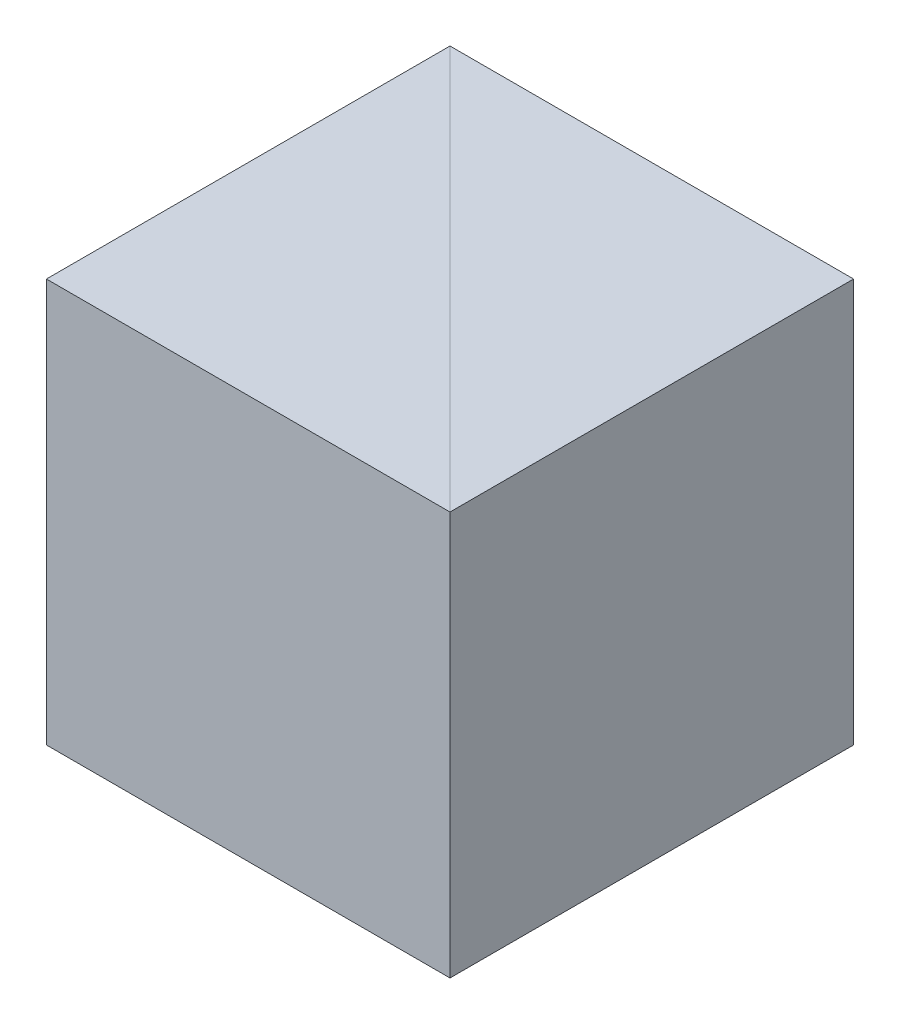
ISO-10303-21;
HEADER;
FILE_DESCRIPTION(('STEP AP214'),'2;1');
FILE_NAME('part.step','',(''),(''),'','','');
FILE_SCHEMA(('AUTOMOTIVE_DESIGN { 1 0 10303 214 1 1 1 1 }'));
ENDSEC;
DATA;
#1=APPLICATION_CONTEXT('core data for automotive mechanical design processes');
#2=APPLICATION_PROTOCOL_DEFINITION('international standard','automotive_design',2000,#1);
#3=PRODUCT_CONTEXT('',#1,'mechanical');
#4=PRODUCT('Part','Part','',(#3));
#5=PRODUCT_RELATED_PRODUCT_CATEGORY('part','',(#4));
#6=PRODUCT_DEFINITION_FORMATION('','',#4);
#7=PRODUCT_DEFINITION_CONTEXT('part definition',#1,'design');
#8=PRODUCT_DEFINITION('design','',#6,#7);
#9=PRODUCT_DEFINITION_SHAPE('','',#8);
#10=(LENGTH_UNIT() NAMED_UNIT(*) SI_UNIT(.MILLI.,.METRE.));
#11=(NAMED_UNIT(*) PLANE_ANGLE_UNIT() SI_UNIT($,.RADIAN.));
#12=(NAMED_UNIT(*) SI_UNIT($,.STERADIAN.) SOLID_ANGLE_UNIT());
#13=UNCERTAINTY_MEASURE_WITH_UNIT(LENGTH_MEASURE(1.E-05),#10,'distance_accuracy_value','');
#14=(GEOMETRIC_REPRESENTATION_CONTEXT(3) GLOBAL_UNCERTAINTY_ASSIGNED_CONTEXT((#13)) GLOBAL_UNIT_ASSIGNED_CONTEXT((#10,
#11,#12)) REPRESENTATION_CONTEXT('',''));
#15=CARTESIAN_POINT('',(0.,0.,0.));
#16=DIRECTION('',(0.,0.,1.));
#17=DIRECTION('',(1.,0.,0.));
#18=AXIS2_PLACEMENT_3D('',#15,#16,#17);
#19=CARTESIAN_POINT('',(25.4,25.4,0.));
#20=DIRECTION('',(-0.707106781186548,0.,0.707106781186548));
#21=DIRECTION('',(0.707106781186548,0.,0.707106781186548));
#22=AXIS2_PLACEMENT_3D('',#19,#20,#21);
#23=PLANE('',#22);
#24=DIRECTION('',(-0.707106781186547,0.,-0.707106781186547));
#25=VECTOR('',#24,1.);
#26=CARTESIAN_POINT('',(25.4,0.,0.));
#27=LINE('',#26,#25);
#28=CARTESIAN_POINT('',(25.4,0.,0.));
#29=VERTEX_POINT('',#28);
#30=CARTESIAN_POINT('',(0.,0.,-25.4));
#31=VERTEX_POINT('',#30);
#32=EDGE_CURVE('E97',#29,#31,#27,.T.);
#33=ORIENTED_EDGE('',*,*,#32,.F.);
#34=DIRECTION('',(0.,-1.,0.));
#35=VECTOR('',#34,1.);
#36=CARTESIAN_POINT('',(25.4,25.4,0.));
#37=LINE('',#36,#35);
#38=CARTESIAN_POINT('',(25.4,25.4,0.));
#39=VERTEX_POINT('',#38);
#40=EDGE_CURVE('E12',#39,#29,#37,.T.);
#41=ORIENTED_EDGE('',*,*,#40,.F.);
#42=DIRECTION('',(-0.707106781186547,0.,-0.707106781186547));
#43=VECTOR('',#42,1.);
#44=CARTESIAN_POINT('',(25.4,25.4,0.));
#45=LINE('',#44,#43);
#46=CARTESIAN_POINT('',(0.,25.4,-25.4));
#47=VERTEX_POINT('',#46);
#48=EDGE_CURVE('E89',#39,#47,#45,.T.);
#49=ORIENTED_EDGE('',*,*,#48,.T.);
#50=DIRECTION('',(0.,-1.,0.));
#51=VECTOR('',#50,1.);
#52=CARTESIAN_POINT('',(0.,25.4,-25.4));
#53=LINE('',#52,#51);
#54=EDGE_CURVE('E48',#47,#31,#53,.T.);
#55=ORIENTED_EDGE('',*,*,#54,.T.);
#56=EDGE_LOOP('',(#33,#41,#49,#55));
#57=FACE_BOUND('',#56,.T.);
#58=ADVANCED_FACE('F45',(#57),#23,.T.);
#59=CARTESIAN_POINT('',(25.4,25.4,-25.4));
#60=DIRECTION('',(1.,0.,0.));
#61=DIRECTION('',(0.,0.,-1.));
#62=AXIS2_PLACEMENT_3D('',#59,#60,#61);
#63=PLANE('',#62);
#64=DIRECTION('',(0.,0.,1.));
#65=VECTOR('',#64,1.);
#66=CARTESIAN_POINT('',(25.4,0.,-25.4));
#67=LINE('',#66,#65);
#68=CARTESIAN_POINT('',(25.4,0.,-25.4));
#69=VERTEX_POINT('',#68);
#70=EDGE_CURVE('E91',#69,#29,#67,.T.);
#71=ORIENTED_EDGE('',*,*,#70,.F.);
#72=DIRECTION('',(0.,-1.,0.));
#73=VECTOR('',#72,1.);
#74=CARTESIAN_POINT('',(25.4,25.4,-25.4));
#75=LINE('',#74,#73);
#76=CARTESIAN_POINT('',(25.4,25.4,-25.4));
#77=VERTEX_POINT('',#76);
#78=EDGE_CURVE('E54',#77,#69,#75,.T.);
#79=ORIENTED_EDGE('',*,*,#78,.F.);
#80=DIRECTION('',(0.,0.,1.));
#81=VECTOR('',#80,1.);
#82=CARTESIAN_POINT('',(25.4,25.4,-25.4));
#83=LINE('',#82,#81);
#84=EDGE_CURVE('E86',#77,#39,#83,.T.);
#85=ORIENTED_EDGE('',*,*,#84,.T.);
#86=ORIENTED_EDGE('',*,*,#40,.T.);
#87=EDGE_LOOP('',(#71,#79,#85,#86));
#88=FACE_BOUND('',#87,.T.);
#89=ADVANCED_FACE('F101',(#88),#63,.T.);
#90=CARTESIAN_POINT('',(0.,25.4,-25.4));
#91=DIRECTION('',(0.,0.,-1.));
#92=DIRECTION('',(-1.,0.,0.));
#93=AXIS2_PLACEMENT_3D('',#90,#91,#92);
#94=PLANE('',#93);
#95=DIRECTION('',(1.,0.,0.));
#96=VECTOR('',#95,1.);
#97=CARTESIAN_POINT('',(0.,0.,-25.4));
#98=LINE('',#97,#96);
#99=EDGE_CURVE('E84',#31,#69,#98,.T.);
#100=ORIENTED_EDGE('',*,*,#99,.F.);
#101=ORIENTED_EDGE('',*,*,#54,.F.);
#102=DIRECTION('',(1.,0.,0.));
#103=VECTOR('',#102,1.);
#104=CARTESIAN_POINT('',(0.,25.4,-25.4));
#105=LINE('',#104,#103);
#106=EDGE_CURVE('E82',#47,#77,#105,.T.);
#107=ORIENTED_EDGE('',*,*,#106,.T.);
#108=ORIENTED_EDGE('',*,*,#78,.T.);
#109=EDGE_LOOP('',(#100,#101,#107,#108));
#110=FACE_BOUND('',#109,.T.);
#111=ADVANCED_FACE('F81',(#110),#94,.T.);
#112=CARTESIAN_POINT('',(0.,25.4,0.));
#113=DIRECTION('',(0.,-1.,0.));
#114=DIRECTION('',(0.,0.,-1.));
#115=AXIS2_PLACEMENT_3D('',#112,#113,#114);
#116=PLANE('',#115);
#117=ORIENTED_EDGE('',*,*,#48,.F.);
#118=ORIENTED_EDGE('',*,*,#84,.F.);
#119=ORIENTED_EDGE('',*,*,#106,.F.);
#120=EDGE_LOOP('',(#117,#118,#119));
#121=FACE_BOUND('',#120,.T.);
#122=ADVANCED_FACE('F88',(#121),#116,.F.);
#123=CARTESIAN_POINT('',(0.,0.,0.));
#124=DIRECTION('',(0.,-1.,0.));
#125=DIRECTION('',(0.,0.,-1.));
#126=AXIS2_PLACEMENT_3D('',#123,#124,#125);
#127=PLANE('',#126);
#128=ORIENTED_EDGE('',*,*,#32,.T.);
#129=ORIENTED_EDGE('',*,*,#99,.T.);
#130=ORIENTED_EDGE('',*,*,#70,.T.);
#131=EDGE_LOOP('',(#128,#129,#130));
#132=FACE_BOUND('',#131,.T.);
#133=ADVANCED_FACE('F100',(#132),#127,.T.);
#134=CLOSED_SHELL('',(#58,#89,#111,#122,#133));
#135=MANIFOLD_SOLID_BREP('B2',#134);
#136=CARTESIAN_POINT('',(25.4,25.4,0.));
#137=DIRECTION('',(0.,0.,-1.));
#138=DIRECTION('',(-1.,0.,0.));
#139=AXIS2_PLACEMENT_3D('',#136,#137,#138);
#140=PLANE('',#139);
#141=DIRECTION('',(1.,0.,0.));
#142=VECTOR('',#141,1.);
#143=CARTESIAN_POINT('',(25.4,0.,0.));
#144=LINE('',#143,#142);
#145=CARTESIAN_POINT('',(0.,0.,0.));
#146=VERTEX_POINT('',#145);
#147=CARTESIAN_POINT('',(25.4,0.,0.));
#148=VERTEX_POINT('',#147);
#149=EDGE_CURVE('E190',#146,#148,#144,.T.);
#150=ORIENTED_EDGE('',*,*,#149,.T.);
#151=DIRECTION('',(0.,-1.,0.));
#152=VECTOR('',#151,1.);
#153=CARTESIAN_POINT('',(25.4,25.4,0.));
#154=LINE('',#153,#152);
#155=CARTESIAN_POINT('',(25.4,25.4,0.));
#156=VERTEX_POINT('',#155);
#157=EDGE_CURVE('E43',#156,#148,#154,.T.);
#158=ORIENTED_EDGE('',*,*,#157,.F.);
#159=DIRECTION('',(1.,0.,0.));
#160=VECTOR('',#159,1.);
#161=CARTESIAN_POINT('',(25.4,25.4,0.));
#162=LINE('',#161,#160);
#163=CARTESIAN_POINT('',(0.,25.4,0.));
#164=VERTEX_POINT('',#163);
#165=EDGE_CURVE('E183',#164,#156,#162,.T.);
#166=ORIENTED_EDGE('',*,*,#165,.F.);
#167=DIRECTION('',(0.,-1.,0.));
#168=VECTOR('',#167,1.);
#169=CARTESIAN_POINT('',(0.,25.4,0.));
#170=LINE('',#169,#168);
#171=EDGE_CURVE('E191',#164,#146,#170,.T.);
#172=ORIENTED_EDGE('',*,*,#171,.T.);
#173=EDGE_LOOP('',(#150,#158,#166,#172));
#174=FACE_BOUND('',#173,.T.);
#175=ADVANCED_FACE('F143',(#174),#140,.F.);
#176=CARTESIAN_POINT('',(0.,25.4,-25.4));
#177=DIRECTION('',(-0.707106781186548,0.,0.707106781186548));
#178=DIRECTION('',(0.707106781186548,0.,0.707106781186548));
#179=AXIS2_PLACEMENT_3D('',#176,#177,#178);
#180=PLANE('',#179);
#181=DIRECTION('',(-0.707106781186547,0.,-0.707106781186547));
#182=VECTOR('',#181,1.);
#183=CARTESIAN_POINT('',(0.,0.,-25.4));
#184=LINE('',#183,#182);
#185=CARTESIAN_POINT('',(0.,0.,-25.4));
#186=VERTEX_POINT('',#185);
#187=EDGE_CURVE('E171',#148,#186,#184,.T.);
#188=ORIENTED_EDGE('',*,*,#187,.T.);
#189=DIRECTION('',(0.,-1.,0.));
#190=VECTOR('',#189,1.);
#191=CARTESIAN_POINT('',(0.,25.4,-25.4));
#192=LINE('',#191,#190);
#193=CARTESIAN_POINT('',(0.,25.4,-25.4));
#194=VERTEX_POINT('',#193);
#195=EDGE_CURVE('E151',#194,#186,#192,.T.);
#196=ORIENTED_EDGE('',*,*,#195,.F.);
#197=DIRECTION('',(-0.707106781186547,0.,-0.707106781186547));
#198=VECTOR('',#197,1.);
#199=CARTESIAN_POINT('',(0.,25.4,-25.4));
#200=LINE('',#199,#198);
#201=EDGE_CURVE('E179',#156,#194,#200,.T.);
#202=ORIENTED_EDGE('',*,*,#201,.F.);
#203=ORIENTED_EDGE('',*,*,#157,.T.);
#204=EDGE_LOOP('',(#188,#196,#202,#203));
#205=FACE_BOUND('',#204,.T.);
#206=ADVANCED_FACE('F180',(#205),#180,.F.);
#207=CARTESIAN_POINT('',(0.,25.4,0.));
#208=DIRECTION('',(1.,0.,0.));
#209=DIRECTION('',(0.,0.,-1.));
#210=AXIS2_PLACEMENT_3D('',#207,#208,#209);
#211=PLANE('',#210);
#212=DIRECTION('',(0.,0.,1.));
#213=VECTOR('',#212,1.);
#214=CARTESIAN_POINT('',(0.,0.,0.));
#215=LINE('',#214,#213);
#216=EDGE_CURVE('E176',#186,#146,#215,.T.);
#217=ORIENTED_EDGE('',*,*,#216,.T.);
#218=ORIENTED_EDGE('',*,*,#171,.F.);
#219=DIRECTION('',(0.,0.,1.));
#220=VECTOR('',#219,1.);
#221=CARTESIAN_POINT('',(0.,25.4,0.));
#222=LINE('',#221,#220);
#223=EDGE_CURVE('E159',#194,#164,#222,.T.);
#224=ORIENTED_EDGE('',*,*,#223,.F.);
#225=ORIENTED_EDGE('',*,*,#195,.T.);
#226=EDGE_LOOP('',(#217,#218,#224,#225));
#227=FACE_BOUND('',#226,.T.);
#228=ADVANCED_FACE('F198',(#227),#211,.F.);
#229=CARTESIAN_POINT('',(0.,25.4,0.));
#230=DIRECTION('',(0.,-1.,0.));
#231=DIRECTION('',(0.,0.,-1.));
#232=AXIS2_PLACEMENT_3D('',#229,#230,#231);
#233=PLANE('',#232);
#234=ORIENTED_EDGE('',*,*,#165,.T.);
#235=ORIENTED_EDGE('',*,*,#201,.T.);
#236=ORIENTED_EDGE('',*,*,#223,.T.);
#237=EDGE_LOOP('',(#234,#235,#236));
#238=FACE_BOUND('',#237,.T.);
#239=ADVANCED_FACE('F186',(#238),#233,.F.);
#240=CARTESIAN_POINT('',(0.,0.,0.));
#241=DIRECTION('',(0.,-1.,0.));
#242=DIRECTION('',(0.,0.,-1.));
#243=AXIS2_PLACEMENT_3D('',#240,#241,#242);
#244=PLANE('',#243);
#245=ORIENTED_EDGE('',*,*,#149,.F.);
#246=ORIENTED_EDGE('',*,*,#216,.F.);
#247=ORIENTED_EDGE('',*,*,#187,.F.);
#248=EDGE_LOOP('',(#245,#246,#247));
#249=FACE_BOUND('',#248,.T.);
#250=ADVANCED_FACE('F199',(#249),#244,.T.);
#251=CLOSED_SHELL('',(#175,#206,#228,#239,#250));
#252=MANIFOLD_SOLID_BREP('B6',#251);
#253=ADVANCED_BREP_SHAPE_REPRESENTATION('',(#18,#135,#252),#14);
#254=SHAPE_DEFINITION_REPRESENTATION(#9,#253);
ENDSEC;
END-ISO-10303-21;
